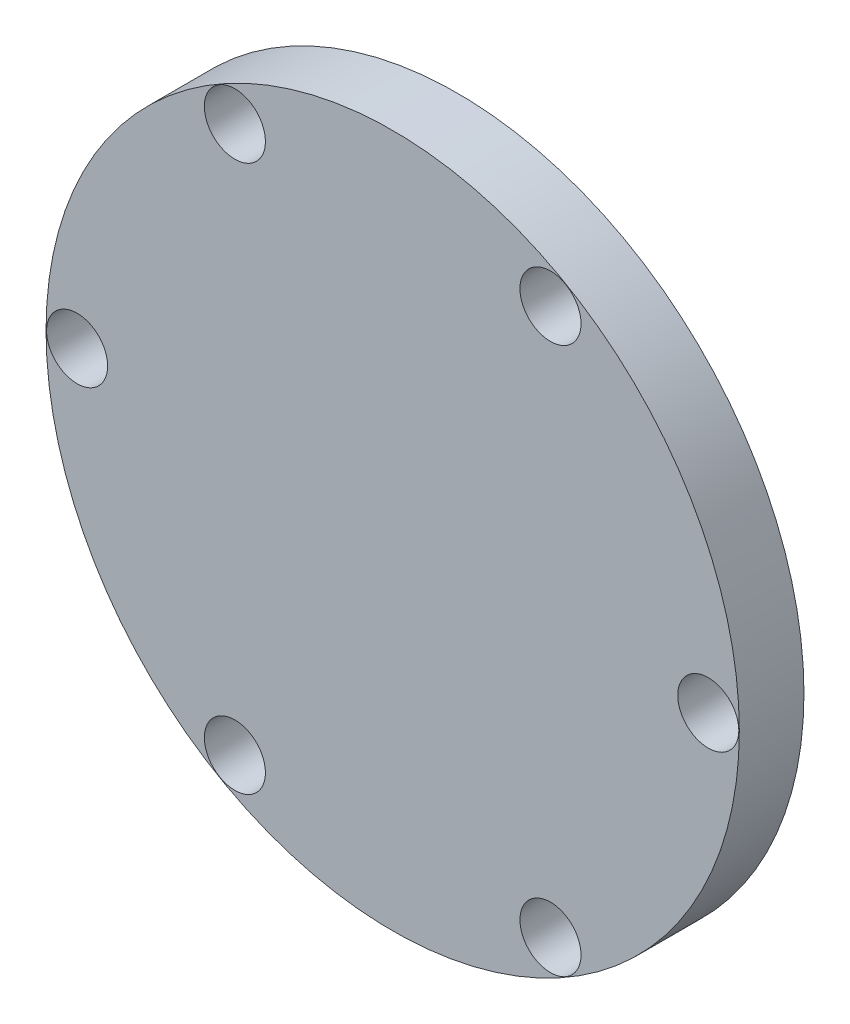
ISO-10303-21;
HEADER;
FILE_DESCRIPTION(('STEP AP214'),'2;1');
FILE_NAME('part.step','',(''),(''),'','','');
FILE_SCHEMA(('AUTOMOTIVE_DESIGN { 1 0 10303 214 1 1 1 1 }'));
ENDSEC;
DATA;
#1=APPLICATION_CONTEXT('core data for automotive mechanical design processes');
#2=APPLICATION_PROTOCOL_DEFINITION('international standard','automotive_design',2000,#1);
#3=PRODUCT_CONTEXT('',#1,'mechanical');
#4=PRODUCT('Part','Part','',(#3));
#5=PRODUCT_RELATED_PRODUCT_CATEGORY('part','',(#4));
#6=PRODUCT_DEFINITION_FORMATION('','',#4);
#7=PRODUCT_DEFINITION_CONTEXT('part definition',#1,'design');
#8=PRODUCT_DEFINITION('design','',#6,#7);
#9=PRODUCT_DEFINITION_SHAPE('','',#8);
#10=(LENGTH_UNIT() NAMED_UNIT(*) SI_UNIT(.MILLI.,.METRE.));
#11=(NAMED_UNIT(*) PLANE_ANGLE_UNIT() SI_UNIT($,.RADIAN.));
#12=(NAMED_UNIT(*) SI_UNIT($,.STERADIAN.) SOLID_ANGLE_UNIT());
#13=UNCERTAINTY_MEASURE_WITH_UNIT(LENGTH_MEASURE(1.E-05),#10,'distance_accuracy_value','');
#14=(GEOMETRIC_REPRESENTATION_CONTEXT(3) GLOBAL_UNCERTAINTY_ASSIGNED_CONTEXT((#13)) GLOBAL_UNIT_ASSIGNED_CONTEXT((#10,
#11,#12)) REPRESENTATION_CONTEXT('',''));
#15=CARTESIAN_POINT('',(0.,0.,0.));
#16=DIRECTION('',(0.,0.,1.));
#17=DIRECTION('',(1.,0.,0.));
#18=AXIS2_PLACEMENT_3D('',#15,#16,#17);
#19=CARTESIAN_POINT('',(-7.75000000000016,-13.4233937586587,3.175));
#20=DIRECTION('',(0.,0.,-1.));
#21=DIRECTION('',(-1.,0.,0.));
#22=AXIS2_PLACEMENT_3D('',#19,#20,#21);
#23=CYLINDRICAL_SURFACE('',#22,1.5);
#24=CARTESIAN_POINT('',(-7.75000000000016,-13.4233937586587,3.175));
#25=DIRECTION('',(0.,0.,1.));
#26=DIRECTION('',(1.,0.,0.));
#27=AXIS2_PLACEMENT_3D('',#24,#25,#26);
#28=CIRCLE('',#27,1.5);
#29=CARTESIAN_POINT('',(-6.25000000000016,-13.4233937586587,3.175));
#30=VERTEX_POINT('',#29);
#31=EDGE_CURVE('E46',#30,#30,#28,.T.);
#32=ORIENTED_EDGE('',*,*,#31,.T.);
#33=EDGE_LOOP('',(#32));
#34=FACE_BOUND('',#33,.T.);
#35=CARTESIAN_POINT('',(-7.75000000000016,-13.4233937586587,0.));
#36=DIRECTION('',(0.,0.,1.));
#37=DIRECTION('',(1.,0.,0.));
#38=AXIS2_PLACEMENT_3D('',#35,#36,#37);
#39=CIRCLE('',#38,1.5);
#40=CARTESIAN_POINT('',(-6.25000000000016,-13.4233937586587,0.));
#41=VERTEX_POINT('',#40);
#42=EDGE_CURVE('E71',#41,#41,#39,.T.);
#43=ORIENTED_EDGE('',*,*,#42,.F.);
#44=EDGE_LOOP('',(#43));
#45=FACE_BOUND('',#44,.T.);
#46=ADVANCED_FACE('F37',(#34,#45),#23,.F.);
#47=CARTESIAN_POINT('',(7.74999999999988,-13.4233937586589,3.175));
#48=DIRECTION('',(0.,0.,-1.));
#49=DIRECTION('',(-1.,0.,0.));
#50=AXIS2_PLACEMENT_3D('',#47,#48,#49);
#51=CYLINDRICAL_SURFACE('',#50,1.5);
#52=CARTESIAN_POINT('',(7.74999999999988,-13.4233937586589,3.175));
#53=DIRECTION('',(0.,0.,1.));
#54=DIRECTION('',(1.,0.,0.));
#55=AXIS2_PLACEMENT_3D('',#52,#53,#54);
#56=CIRCLE('',#55,1.5);
#57=CARTESIAN_POINT('',(9.24999999999988,-13.4233937586589,3.175));
#58=VERTEX_POINT('',#57);
#59=EDGE_CURVE('E53',#58,#58,#56,.T.);
#60=ORIENTED_EDGE('',*,*,#59,.T.);
#61=EDGE_LOOP('',(#60));
#62=FACE_BOUND('',#61,.T.);
#63=CARTESIAN_POINT('',(7.74999999999988,-13.4233937586589,0.));
#64=DIRECTION('',(0.,0.,1.));
#65=DIRECTION('',(1.,0.,0.));
#66=AXIS2_PLACEMENT_3D('',#63,#64,#65);
#67=CIRCLE('',#66,1.5);
#68=CARTESIAN_POINT('',(9.24999999999988,-13.4233937586589,0.));
#69=VERTEX_POINT('',#68);
#70=EDGE_CURVE('E69',#69,#69,#67,.T.);
#71=ORIENTED_EDGE('',*,*,#70,.F.);
#72=EDGE_LOOP('',(#71));
#73=FACE_BOUND('',#72,.T.);
#74=ADVANCED_FACE('F96',(#62,#73),#51,.F.);
#75=CARTESIAN_POINT('',(15.5,-1.08235921504137E-13,3.175));
#76=DIRECTION('',(0.,0.,-1.));
#77=DIRECTION('',(-1.,0.,0.));
#78=AXIS2_PLACEMENT_3D('',#75,#76,#77);
#79=CYLINDRICAL_SURFACE('',#78,1.5);
#80=CARTESIAN_POINT('',(15.5,-1.08235921504137E-13,3.175));
#81=DIRECTION('',(0.,0.,1.));
#82=DIRECTION('',(1.,0.,0.));
#83=AXIS2_PLACEMENT_3D('',#80,#81,#82);
#84=CIRCLE('',#83,1.5);
#85=CARTESIAN_POINT('',(17.,-1.08235921504137E-13,3.175));
#86=VERTEX_POINT('',#85);
#87=EDGE_CURVE('E91',#86,#86,#84,.T.);
#88=ORIENTED_EDGE('',*,*,#87,.T.);
#89=EDGE_LOOP('',(#88));
#90=FACE_BOUND('',#89,.T.);
#91=CARTESIAN_POINT('',(15.5,-1.08235921504137E-13,0.));
#92=DIRECTION('',(0.,0.,1.));
#93=DIRECTION('',(1.,0.,0.));
#94=AXIS2_PLACEMENT_3D('',#91,#92,#93);
#95=CIRCLE('',#94,1.5);
#96=CARTESIAN_POINT('',(17.,-1.08235921504137E-13,0.));
#97=VERTEX_POINT('',#96);
#98=EDGE_CURVE('E66',#97,#97,#95,.T.);
#99=ORIENTED_EDGE('',*,*,#98,.F.);
#100=EDGE_LOOP('',(#99));
#101=FACE_BOUND('',#100,.T.);
#102=ADVANCED_FACE('F114',(#90,#101),#79,.F.);
#103=CARTESIAN_POINT('',(7.75000000000006,13.4233937586588,3.175));
#104=DIRECTION('',(0.,0.,-1.));
#105=DIRECTION('',(-1.,0.,0.));
#106=AXIS2_PLACEMENT_3D('',#103,#104,#105);
#107=CYLINDRICAL_SURFACE('',#106,1.5);
#108=CARTESIAN_POINT('',(7.75000000000006,13.4233937586588,3.175));
#109=DIRECTION('',(0.,0.,1.));
#110=DIRECTION('',(1.,0.,0.));
#111=AXIS2_PLACEMENT_3D('',#108,#109,#110);
#112=CIRCLE('',#111,1.5);
#113=CARTESIAN_POINT('',(9.25000000000007,13.4233937586588,3.175));
#114=VERTEX_POINT('',#113);
#115=EDGE_CURVE('E86',#114,#114,#112,.T.);
#116=ORIENTED_EDGE('',*,*,#115,.T.);
#117=EDGE_LOOP('',(#116));
#118=FACE_BOUND('',#117,.T.);
#119=CARTESIAN_POINT('',(7.75000000000006,13.4233937586588,0.));
#120=DIRECTION('',(0.,0.,1.));
#121=DIRECTION('',(1.,0.,0.));
#122=AXIS2_PLACEMENT_3D('',#119,#120,#121);
#123=CIRCLE('',#122,1.5);
#124=CARTESIAN_POINT('',(9.25000000000007,13.4233937586588,0.));
#125=VERTEX_POINT('',#124);
#126=EDGE_CURVE('E63',#125,#125,#123,.T.);
#127=ORIENTED_EDGE('',*,*,#126,.F.);
#128=EDGE_LOOP('',(#127));
#129=FACE_BOUND('',#128,.T.);
#130=ADVANCED_FACE('F121',(#118,#129),#107,.F.);
#131=CARTESIAN_POINT('',(-7.74999999999997,13.4233937586588,3.175));
#132=DIRECTION('',(0.,0.,-1.));
#133=DIRECTION('',(-1.,0.,0.));
#134=AXIS2_PLACEMENT_3D('',#131,#132,#133);
#135=CYLINDRICAL_SURFACE('',#134,1.5);
#136=CARTESIAN_POINT('',(-7.74999999999997,13.4233937586588,3.175));
#137=DIRECTION('',(0.,0.,1.));
#138=DIRECTION('',(1.,0.,0.));
#139=AXIS2_PLACEMENT_3D('',#136,#137,#138);
#140=CIRCLE('',#139,1.5);
#141=CARTESIAN_POINT('',(-6.24999999999997,13.4233937586588,3.175));
#142=VERTEX_POINT('',#141);
#143=EDGE_CURVE('E81',#142,#142,#140,.T.);
#144=ORIENTED_EDGE('',*,*,#143,.T.);
#145=EDGE_LOOP('',(#144));
#146=FACE_BOUND('',#145,.T.);
#147=CARTESIAN_POINT('',(-7.74999999999997,13.4233937586588,0.));
#148=DIRECTION('',(0.,0.,1.));
#149=DIRECTION('',(1.,0.,0.));
#150=AXIS2_PLACEMENT_3D('',#147,#148,#149);
#151=CIRCLE('',#150,1.5);
#152=CARTESIAN_POINT('',(-6.24999999999997,13.4233937586588,0.));
#153=VERTEX_POINT('',#152);
#154=EDGE_CURVE('E60',#153,#153,#151,.T.);
#155=ORIENTED_EDGE('',*,*,#154,.F.);
#156=EDGE_LOOP('',(#155));
#157=FACE_BOUND('',#156,.T.);
#158=ADVANCED_FACE('F124',(#146,#157),#135,.F.);
#159=CARTESIAN_POINT('',(-15.5,0.,3.175));
#160=DIRECTION('',(0.,0.,-1.));
#161=DIRECTION('',(-1.,0.,0.));
#162=AXIS2_PLACEMENT_3D('',#159,#160,#161);
#163=CYLINDRICAL_SURFACE('',#162,1.5);
#164=CARTESIAN_POINT('',(-15.5,0.,3.175));
#165=DIRECTION('',(0.,0.,1.));
#166=DIRECTION('',(1.,0.,0.));
#167=AXIS2_PLACEMENT_3D('',#164,#165,#166);
#168=CIRCLE('',#167,1.5);
#169=CARTESIAN_POINT('',(-14.,0.,3.175));
#170=VERTEX_POINT('',#169);
#171=EDGE_CURVE('E77',#170,#170,#168,.T.);
#172=ORIENTED_EDGE('',*,*,#171,.T.);
#173=EDGE_LOOP('',(#172));
#174=FACE_BOUND('',#173,.T.);
#175=CARTESIAN_POINT('',(-15.5,0.,0.));
#176=DIRECTION('',(0.,0.,1.));
#177=DIRECTION('',(1.,0.,0.));
#178=AXIS2_PLACEMENT_3D('',#175,#176,#177);
#179=CIRCLE('',#178,1.5);
#180=CARTESIAN_POINT('',(-14.,0.,0.));
#181=VERTEX_POINT('',#180);
#182=EDGE_CURVE('E57',#181,#181,#179,.T.);
#183=ORIENTED_EDGE('',*,*,#182,.F.);
#184=EDGE_LOOP('',(#183));
#185=FACE_BOUND('',#184,.T.);
#186=ADVANCED_FACE('F39',(#174,#185),#163,.F.);
#187=CARTESIAN_POINT('',(0.,0.,3.175));
#188=DIRECTION('',(0.,0.,-1.));
#189=DIRECTION('',(-1.,0.,0.));
#190=AXIS2_PLACEMENT_3D('',#187,#188,#189);
#191=CYLINDRICAL_SURFACE('',#190,17.0256792441741);
#192=CARTESIAN_POINT('',(0.,0.,3.175));
#193=DIRECTION('',(0.,0.,1.));
#194=DIRECTION('',(1.,0.,0.));
#195=AXIS2_PLACEMENT_3D('',#192,#193,#194);
#196=CIRCLE('',#195,17.0256792441741);
#197=CARTESIAN_POINT('',(17.0256792441741,0.,3.175));
#198=VERTEX_POINT('',#197);
#199=EDGE_CURVE('E10',#198,#198,#196,.T.);
#200=ORIENTED_EDGE('',*,*,#199,.F.);
#201=EDGE_LOOP('',(#200));
#202=FACE_BOUND('',#201,.T.);
#203=CARTESIAN_POINT('',(0.,0.,0.));
#204=DIRECTION('',(0.,0.,1.));
#205=DIRECTION('',(1.,0.,0.));
#206=AXIS2_PLACEMENT_3D('',#203,#204,#205);
#207=CIRCLE('',#206,17.0256792441741);
#208=CARTESIAN_POINT('',(17.0256792441741,0.,0.));
#209=VERTEX_POINT('',#208);
#210=EDGE_CURVE('E41',#209,#209,#207,.T.);
#211=ORIENTED_EDGE('',*,*,#210,.T.);
#212=EDGE_LOOP('',(#211));
#213=FACE_BOUND('',#212,.T.);
#214=ADVANCED_FACE('F103',(#202,#213),#191,.T.);
#215=CARTESIAN_POINT('',(0.,0.,3.175));
#216=DIRECTION('',(0.,0.,1.));
#217=DIRECTION('',(1.,0.,0.));
#218=AXIS2_PLACEMENT_3D('',#215,#216,#217);
#219=PLANE('',#218);
#220=ORIENTED_EDGE('',*,*,#171,.F.);
#221=EDGE_LOOP('',(#220));
#222=FACE_BOUND('',#221,.T.);
#223=ORIENTED_EDGE('',*,*,#143,.F.);
#224=EDGE_LOOP('',(#223));
#225=FACE_BOUND('',#224,.T.);
#226=ORIENTED_EDGE('',*,*,#115,.F.);
#227=EDGE_LOOP('',(#226));
#228=FACE_BOUND('',#227,.T.);
#229=ORIENTED_EDGE('',*,*,#87,.F.);
#230=EDGE_LOOP('',(#229));
#231=FACE_BOUND('',#230,.T.);
#232=ORIENTED_EDGE('',*,*,#59,.F.);
#233=EDGE_LOOP('',(#232));
#234=FACE_BOUND('',#233,.T.);
#235=ORIENTED_EDGE('',*,*,#31,.F.);
#236=EDGE_LOOP('',(#235));
#237=FACE_BOUND('',#236,.T.);
#238=ORIENTED_EDGE('',*,*,#199,.T.);
#239=EDGE_LOOP('',(#238));
#240=FACE_BOUND('',#239,.T.);
#241=ADVANCED_FACE('F99',(#222,#225,#228,#231,#234,#237,#240),#219,.T.);
#242=CARTESIAN_POINT('',(0.,0.,0.));
#243=DIRECTION('',(0.,0.,1.));
#244=DIRECTION('',(1.,0.,0.));
#245=AXIS2_PLACEMENT_3D('',#242,#243,#244);
#246=PLANE('',#245);
#247=ORIENTED_EDGE('',*,*,#182,.T.);
#248=EDGE_LOOP('',(#247));
#249=FACE_BOUND('',#248,.T.);
#250=ORIENTED_EDGE('',*,*,#154,.T.);
#251=EDGE_LOOP('',(#250));
#252=FACE_BOUND('',#251,.T.);
#253=ORIENTED_EDGE('',*,*,#126,.T.);
#254=EDGE_LOOP('',(#253));
#255=FACE_BOUND('',#254,.T.);
#256=ORIENTED_EDGE('',*,*,#98,.T.);
#257=EDGE_LOOP('',(#256));
#258=FACE_BOUND('',#257,.T.);
#259=ORIENTED_EDGE('',*,*,#70,.T.);
#260=EDGE_LOOP('',(#259));
#261=FACE_BOUND('',#260,.T.);
#262=ORIENTED_EDGE('',*,*,#42,.T.);
#263=EDGE_LOOP('',(#262));
#264=FACE_BOUND('',#263,.T.);
#265=ORIENTED_EDGE('',*,*,#210,.F.);
#266=EDGE_LOOP('',(#265));
#267=FACE_BOUND('',#266,.T.);
#268=ADVANCED_FACE('F102',(#249,#252,#255,#258,#261,#264,#267),#246,.F.);
#269=CLOSED_SHELL('',(#46,#74,#102,#130,#158,#186,#214,#241,#268));
#270=MANIFOLD_SOLID_BREP('B2',#269);
#271=ADVANCED_BREP_SHAPE_REPRESENTATION('',(#18,#270),#14);
#272=SHAPE_DEFINITION_REPRESENTATION(#9,#271);
ENDSEC;
END-ISO-10303-21;
